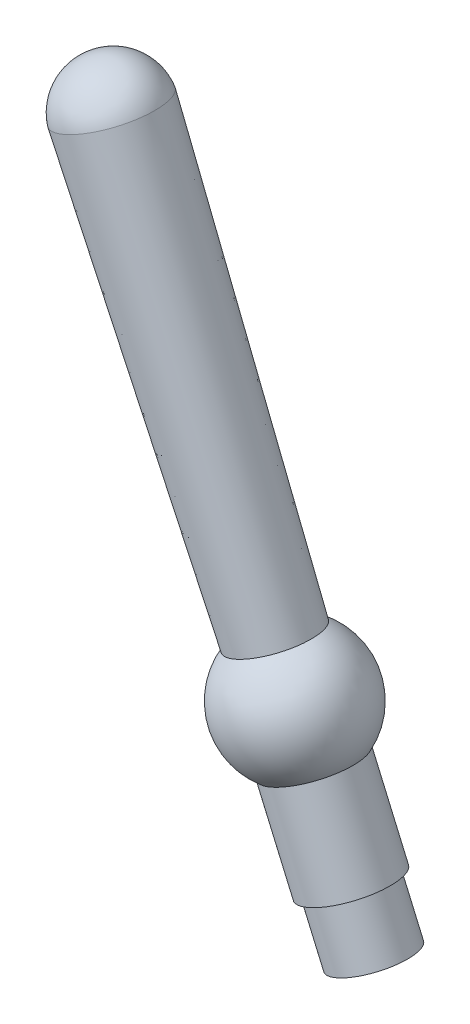
ISO-10303-21;
HEADER;
FILE_DESCRIPTION(('STEP AP214'),'2;1');
FILE_NAME('part.step','',(''),(''),'','','');
FILE_SCHEMA(('AUTOMOTIVE_DESIGN { 1 0 10303 214 1 1 1 1 }'));
ENDSEC;
DATA;
#1=APPLICATION_CONTEXT('core data for automotive mechanical design processes');
#2=APPLICATION_PROTOCOL_DEFINITION('international standard','automotive_design',2000,#1);
#3=PRODUCT_CONTEXT('',#1,'mechanical');
#4=PRODUCT('Part','Part','',(#3));
#5=PRODUCT_RELATED_PRODUCT_CATEGORY('part','',(#4));
#6=PRODUCT_DEFINITION_FORMATION('','',#4);
#7=PRODUCT_DEFINITION_CONTEXT('part definition',#1,'design');
#8=PRODUCT_DEFINITION('design','',#6,#7);
#9=PRODUCT_DEFINITION_SHAPE('','',#8);
#10=(LENGTH_UNIT() NAMED_UNIT(*) SI_UNIT(.MILLI.,.METRE.));
#11=(NAMED_UNIT(*) PLANE_ANGLE_UNIT() SI_UNIT($,.RADIAN.));
#12=(NAMED_UNIT(*) SI_UNIT($,.STERADIAN.) SOLID_ANGLE_UNIT());
#13=UNCERTAINTY_MEASURE_WITH_UNIT(LENGTH_MEASURE(1.E-05),#10,'distance_accuracy_value','');
#14=(GEOMETRIC_REPRESENTATION_CONTEXT(3) GLOBAL_UNCERTAINTY_ASSIGNED_CONTEXT((#13)) GLOBAL_UNIT_ASSIGNED_CONTEXT((#10,
#11,#12)) REPRESENTATION_CONTEXT('',''));
#15=CARTESIAN_POINT('',(0.,0.,0.));
#16=DIRECTION('',(0.,0.,1.));
#17=DIRECTION('',(1.,0.,0.));
#18=AXIS2_PLACEMENT_3D('',#15,#16,#17);
#19=CARTESIAN_POINT('',(-3.431167540812,5.410331302705,0.));
#20=DIRECTION('',(0.397948631308117,-0.917407699357269,0.));
#21=DIRECTION('',(0.917407699357269,0.397948631308117,0.));
#22=AXIS2_PLACEMENT_3D('',#19,#20,#21);
#23=PLANE('',#22);
#24=CARTESIAN_POINT('',(-3.06420446107537,5.56951075522581,0.));
#25=DIRECTION('',(-0.397948631308117,0.917407699357269,0.));
#26=DIRECTION('',(-0.917407699357269,-0.397948631308117,0.));
#27=AXIS2_PLACEMENT_3D('',#24,#25,#26);
#28=CIRCLE('',#27,0.8);
#29=CARTESIAN_POINT('',(-3.79813062056118,5.25115185017932,0.));
#30=VERTEX_POINT('',#29);
#31=EDGE_CURVE('E21',#30,#30,#28,.F.);
#32=ORIENTED_EDGE('',*,*,#31,.T.);
#33=EDGE_LOOP('',(#32));
#34=FACE_BOUND('',#33,.T.);
#35=ADVANCED_FACE('F17',(#34),#23,.T.);
#36=CARTESIAN_POINT('',(2.347896924715,-6.907233956033,0.));
#37=DIRECTION('',(-0.397948631308117,0.917407699357269,0.));
#38=DIRECTION('',(-0.917407699357269,-0.397948631308117,0.));
#39=AXIS2_PLACEMENT_3D('',#36,#37,#38);
#40=CYLINDRICAL_SURFACE('',#39,0.8);
#41=ORIENTED_EDGE('',*,*,#31,.F.);
#42=EDGE_LOOP('',(#41));
#43=FACE_BOUND('',#42,.T.);
#44=CARTESIAN_POINT('',(2.34789692471521,-6.90723395603348,0.));
#45=DIRECTION('',(-0.397948631308117,0.917407699357269,0.));
#46=DIRECTION('',(-0.917407699357269,-0.397948631308117,0.));
#47=AXIS2_PLACEMENT_3D('',#44,#45,#46);
#48=CIRCLE('',#47,0.8);
#49=CARTESIAN_POINT('',(1.61397076522939,-7.22559286107998,0.));
#50=VERTEX_POINT('',#49);
#51=EDGE_CURVE('E66',#50,#50,#48,.T.);
#52=ORIENTED_EDGE('',*,*,#51,.F.);
#53=EDGE_LOOP('',(#52));
#54=FACE_BOUND('',#53,.T.);
#55=ADVANCED_FACE('F74',(#43,#54),#40,.F.);
#56=CARTESIAN_POINT('',(1.476359610325,-7.285285155776,0.));
#57=DIRECTION('',(0.397948631308117,-0.917407699357269,0.));
#58=DIRECTION('',(0.917407699357269,0.397948631308117,0.));
#59=AXIS2_PLACEMENT_3D('',#56,#57,#58);
#60=PLANE('',#59);
#61=CARTESIAN_POINT('',(2.34789692471534,-6.90723395603378,0.));
#62=DIRECTION('',(-0.397948631308117,0.917407699357269,0.));
#63=DIRECTION('',(-0.917407699357269,-0.397948631308117,0.));
#64=AXIS2_PLACEMENT_3D('',#61,#62,#63);
#65=CIRCLE('',#64,1.1);
#66=CARTESIAN_POINT('',(1.33874845542234,-7.34497745047271,0.));
#67=VERTEX_POINT('',#66);
#68=EDGE_CURVE('E64',#67,#67,#65,.T.);
#69=ORIENTED_EDGE('',*,*,#68,.F.);
#70=EDGE_LOOP('',(#69));
#71=FACE_BOUND('',#70,.T.);
#72=ORIENTED_EDGE('',*,*,#51,.T.);
#73=EDGE_LOOP('',(#72));
#74=FACE_BOUND('',#73,.T.);
#75=ADVANCED_FACE('F77',(#71,#74),#60,.T.);
#76=CARTESIAN_POINT('',(2.347896924715,-6.907233956033,0.));
#77=DIRECTION('',(-0.397948631308117,0.917407699357269,0.));
#78=DIRECTION('',(-0.917407699357269,-0.397948631308117,0.));
#79=AXIS2_PLACEMENT_3D('',#76,#77,#78);
#80=CYLINDRICAL_SURFACE('',#79,1.1);
#81=ORIENTED_EDGE('',*,*,#68,.T.);
#82=EDGE_LOOP('',(#81));
#83=FACE_BOUND('',#82,.T.);
#84=CARTESIAN_POINT('',(1.67138425149112,-5.34764086712545,0.));
#85=DIRECTION('',(-0.397948631308117,0.917407699357269,0.));
#86=DIRECTION('',(-0.917407699357269,-0.397948631308117,0.));
#87=AXIS2_PLACEMENT_3D('',#84,#85,#86);
#88=CIRCLE('',#87,1.1);
#89=CARTESIAN_POINT('',(0.662235782198123,-5.78538436156438,0.));
#90=VERTEX_POINT('',#89);
#91=EDGE_CURVE('E61',#90,#90,#88,.T.);
#92=ORIENTED_EDGE('',*,*,#91,.F.);
#93=EDGE_LOOP('',(#92));
#94=FACE_BOUND('',#93,.T.);
#95=ADVANCED_FACE('F83',(#83,#94),#80,.T.);
#96=CARTESIAN_POINT('',(0.584256127753,-5.819209995225,0.));
#97=DIRECTION('',(0.397948631308117,-0.917407699357269,0.));
#98=DIRECTION('',(0.917407699357269,0.397948631308117,0.));
#99=AXIS2_PLACEMENT_3D('',#96,#97,#98);
#100=PLANE('',#99);
#101=CARTESIAN_POINT('',(1.67138425149216,-5.34764086712636,0.));
#102=DIRECTION('',(-0.397948631308117,0.917407699357269,0.));
#103=DIRECTION('',(-0.917407699357269,-0.397948631308117,0.));
#104=AXIS2_PLACEMENT_3D('',#101,#102,#103);
#105=CIRCLE('',#104,1.27);
#106=CARTESIAN_POINT('',(0.506276473308424,-5.85303562888766,0.));
#107=VERTEX_POINT('',#106);
#108=EDGE_CURVE('E58',#107,#107,#105,.T.);
#109=ORIENTED_EDGE('',*,*,#108,.F.);
#110=EDGE_LOOP('',(#109));
#111=FACE_BOUND('',#110,.T.);
#112=ORIENTED_EDGE('',*,*,#91,.T.);
#113=EDGE_LOOP('',(#112));
#114=FACE_BOUND('',#113,.T.);
#115=ADVANCED_FACE('F88',(#111,#114),#100,.T.);
#116=CARTESIAN_POINT('',(1.671384251492,-5.347640867126,0.));
#117=DIRECTION('',(-0.397948631308117,0.917407699357269,0.));
#118=DIRECTION('',(-0.917407699357269,-0.397948631308117,0.));
#119=AXIS2_PLACEMENT_3D('',#116,#117,#118);
#120=CYLINDRICAL_SURFACE('',#119,1.27);
#121=ORIENTED_EDGE('',*,*,#108,.T.);
#122=EDGE_LOOP('',(#121));
#123=FACE_BOUND('',#122,.T.);
#124=CARTESIAN_POINT('',(0.565197474517427,-2.79750201431026,0.));
#125=DIRECTION('',(-0.397948631308117,0.917407699357269,0.));
#126=DIRECTION('',(-0.917407699357269,-0.397948631308117,0.));
#127=AXIS2_PLACEMENT_3D('',#124,#125,#126);
#128=CIRCLE('',#127,1.27);
#129=CARTESIAN_POINT('',(-0.599910303666304,-3.30289677607157,0.));
#130=VERTEX_POINT('',#129);
#131=EDGE_CURVE('E55',#130,#130,#128,.T.);
#132=ORIENTED_EDGE('',*,*,#131,.F.);
#133=EDGE_LOOP('',(#132));
#134=FACE_BOUND('',#133,.T.);
#135=ADVANCED_FACE('F45',(#123,#134),#120,.T.);
#136=CARTESIAN_POINT('',(0.,-1.494528529824,0.));
#137=DIRECTION('',(0.,0.,1.));
#138=DIRECTION('',(-1.,0.,0.));
#139=AXIS2_PLACEMENT_3D('',#136,#137,#138);
#140=SPHERICAL_SURFACE('',#139,1.90527900489);
#141=CARTESIAN_POINT('',(0.,-1.494528529824,0.));
#142=DIRECTION('',(-0.397948631308114,0.91740769935727,0.));
#143=DIRECTION('',(-0.91740769935727,-0.397948631308114,0.));
#144=AXIS2_PLACEMENT_3D('',#141,#142,#143);
#145=SPHERICAL_SURFACE('',#144,1.90527900489);
#146=CARTESIAN_POINT('',(-0.594745582832412,-0.123436549795788,0.));
#147=DIRECTION('',(-0.397948631308114,0.91740769935727,0.));
#148=DIRECTION('',(-0.91740769935727,-0.397948631308114,0.));
#149=AXIS2_PLACEMENT_3D('',#146,#147,#148);
#150=CIRCLE('',#149,1.18172440294701);
#151=CARTESIAN_POINT('',(-1.67886864861437,-0.59370215853195,0.));
#152=VERTEX_POINT('',#151);
#153=EDGE_CURVE('E25',#152,#152,#150,.T.);
#154=ORIENTED_EDGE('',*,*,#153,.F.);
#155=EDGE_LOOP('',(#154));
#156=FACE_BOUND('',#155,.T.);
#157=ORIENTED_EDGE('',*,*,#131,.T.);
#158=EDGE_LOOP('',(#157));
#159=FACE_BOUND('',#158,.T.);
#160=ADVANCED_FACE('F19',(#156,#159),#145,.T.);
#161=CARTESIAN_POINT('',(-5.963395897314,12.253138581221,0.));
#162=CARTESIAN_POINT('',(-5.772864231732,12.337446181348,0.));
#163=CARTESIAN_POINT('',(-5.566649694852,12.386317061964,0.));
#164=CARTESIAN_POINT('',(-5.353538539707,12.395813740859,0.));
#165=CARTESIAN_POINT('',(-5.143794427856,12.365478847802,0.));
#166=CARTESIAN_POINT('',(-4.749243603678,12.231426636868,0.));
#167=CARTESIAN_POINT('',(-4.564432357697,12.127707778642,0.));
#168=CARTESIAN_POINT('',(-4.401216169215,11.990350481149,0.));
#169=CARTESIAN_POINT('',(-4.267455704739,11.825970019,0.));
#170=CARTESIAN_POINT('',(-4.16771994892,11.643041437199,0.));
#171=(BOUNDED_CURVE() B_SPLINE_CURVE(5,(#161,#162,#163,#164,#165,#166,#167,#168,#169,#170),
.UNSPECIFIED.,.F.,.F.) B_SPLINE_CURVE_WITH_KNOTS((6,4,6),(4.705080926186,5.44919119332,
6.193301460454),
.UNSPECIFIED.) CURVE() GEOMETRIC_REPRESENTATION_ITEM() RATIONAL_B_SPLINE_CURVE((1.,1.,1.,1.,1.,
1.,1.,1.,1.,1.)) REPRESENTATION_ITEM(''));
#172=CARTESIAN_POINT('',(-5.40628269087,10.968802099584,0.));
#173=DIRECTION('',(-0.397948631307751,0.917407699357427,0.));
#174=AXIS1_PLACEMENT('',#172,#173);
#175=SURFACE_OF_REVOLUTION('',#171,#174);
#176=CARTESIAN_POINT('',(-5.96339589731458,12.2531385812208,0.));
#177=VERTEX_POINT('',#176);
#178=VERTEX_LOOP('',#177);
#179=FACE_BOUND('',#178,.T.);
#180=CARTESIAN_POINT('',(-5.45629210406985,11.0840909009359,0.));
#181=DIRECTION('',(-0.397948631308117,0.917407699357269,0.));
#182=DIRECTION('',(-0.917407699357261,-0.397948631308135,0.));
#183=AXIS2_PLACEMENT_3D('',#180,#181,#182);
#184=CIRCLE('',#183,1.40457961527626);
#185=CARTESIAN_POINT('',(-6.74486425748455,10.5251403654734,0.));
#186=VERTEX_POINT('',#185);
#187=EDGE_CURVE('E11',#186,#186,#184,.F.);
#188=ORIENTED_EDGE('',*,*,#187,.F.);
#189=EDGE_LOOP('',(#188));
#190=FACE_BOUND('',#189,.T.);
#191=ADVANCED_FACE('F29',(#179,#190),#175,.F.);
#192=CARTESIAN_POINT('',(-5.45629210402383,11.0840909008298,0.));
#193=DIRECTION('',(-0.397948631308114,0.91740769935727,0.));
#194=DIRECTION('',(-0.91740769935727,-0.397948631308114,0.));
#195=AXIS2_PLACEMENT_3D('',#192,#193,#194);
#196=CONICAL_SURFACE('',#195,1.40457961529543,0.0182400993047642);
#197=ORIENTED_EDGE('',*,*,#153,.T.);
#198=EDGE_LOOP('',(#197));
#199=FACE_BOUND('',#198,.T.);
#200=ORIENTED_EDGE('',*,*,#187,.T.);
#201=EDGE_LOOP('',(#200));
#202=FACE_BOUND('',#201,.T.);
#203=ADVANCED_FACE('F32',(#199,#202),#196,.T.);
#204=CLOSED_SHELL('',(#35,#55,#75,#95,#115,#135,#160,#191,#203));
#205=MANIFOLD_SOLID_BREP('B1',#204);
#206=ADVANCED_BREP_SHAPE_REPRESENTATION('',(#18,#205),#14);
#207=SHAPE_DEFINITION_REPRESENTATION(#9,#206);
ENDSEC;
END-ISO-10303-21;
